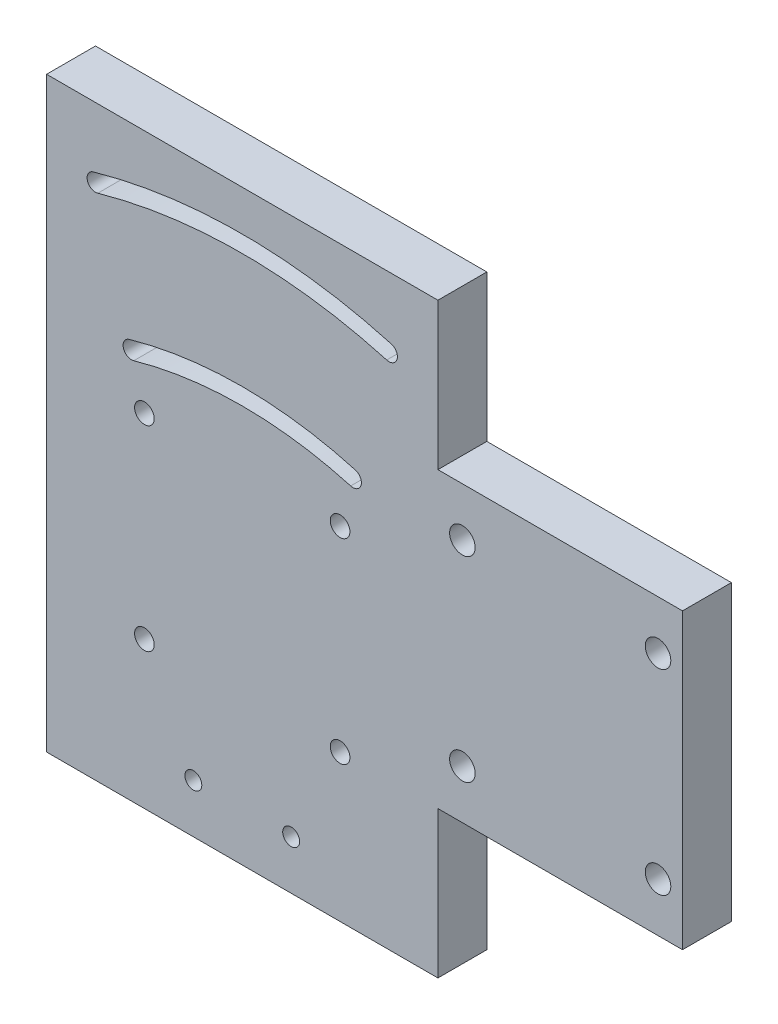
ISO-10303-21;
HEADER;
FILE_DESCRIPTION(('STEP AP214'),'2;1');
FILE_NAME('part.step','',(''),(''),'','','');
FILE_SCHEMA(('AUTOMOTIVE_DESIGN { 1 0 10303 214 1 1 1 1 }'));
ENDSEC;
DATA;
#1=APPLICATION_CONTEXT('core data for automotive mechanical design processes');
#2=APPLICATION_PROTOCOL_DEFINITION('international standard','automotive_design',2000,#1);
#3=PRODUCT_CONTEXT('',#1,'mechanical');
#4=PRODUCT('Part','Part','',(#3));
#5=PRODUCT_RELATED_PRODUCT_CATEGORY('part','',(#4));
#6=PRODUCT_DEFINITION_FORMATION('','',#4);
#7=PRODUCT_DEFINITION_CONTEXT('part definition',#1,'design');
#8=PRODUCT_DEFINITION('design','',#6,#7);
#9=PRODUCT_DEFINITION_SHAPE('','',#8);
#10=(LENGTH_UNIT() NAMED_UNIT(*) SI_UNIT(.MILLI.,.METRE.));
#11=(NAMED_UNIT(*) PLANE_ANGLE_UNIT() SI_UNIT($,.RADIAN.));
#12=(NAMED_UNIT(*) SI_UNIT($,.STERADIAN.) SOLID_ANGLE_UNIT());
#13=UNCERTAINTY_MEASURE_WITH_UNIT(LENGTH_MEASURE(1.E-05),#10,'distance_accuracy_value','');
#14=(GEOMETRIC_REPRESENTATION_CONTEXT(3) GLOBAL_UNCERTAINTY_ASSIGNED_CONTEXT((#13)) GLOBAL_UNIT_ASSIGNED_CONTEXT((#10,
#11,#12)) REPRESENTATION_CONTEXT('',''));
#15=CARTESIAN_POINT('',(0.,0.,0.));
#16=DIRECTION('',(0.,0.,1.));
#17=DIRECTION('',(1.,0.,0.));
#18=AXIS2_PLACEMENT_3D('',#15,#16,#17);
#19=CARTESIAN_POINT('',(101.6,38.1,0.));
#20=DIRECTION('',(0.,0.,1.));
#21=DIRECTION('',(1.,0.,0.));
#22=AXIS2_PLACEMENT_3D('',#19,#20,#21);
#23=PLANE('',#22);
#24=CARTESIAN_POINT('',(63.5,12.7,0.));
#25=DIRECTION('',(0.,0.,1.));
#26=DIRECTION('',(1.,0.,0.));
#27=AXIS2_PLACEMENT_3D('',#24,#25,#26);
#28=CIRCLE('',#27,2.1971);
#29=CARTESIAN_POINT('',(65.6971,12.7,0.));
#30=VERTEX_POINT('',#29);
#31=EDGE_CURVE('E498',#30,#30,#28,.T.);
#32=ORIENTED_EDGE('',*,*,#31,.T.);
#33=EDGE_LOOP('',(#32));
#34=FACE_BOUND('',#33,.T.);
#35=CARTESIAN_POINT('',(38.1,12.7,0.));
#36=DIRECTION('',(0.,0.,1.));
#37=DIRECTION('',(1.,0.,0.));
#38=AXIS2_PLACEMENT_3D('',#35,#36,#37);
#39=CIRCLE('',#38,2.1971);
#40=CARTESIAN_POINT('',(40.2971,12.7,0.));
#41=VERTEX_POINT('',#40);
#42=EDGE_CURVE('E501',#41,#41,#39,.T.);
#43=ORIENTED_EDGE('',*,*,#42,.T.);
#44=EDGE_LOOP('',(#43));
#45=FACE_BOUND('',#44,.T.);
#46=CARTESIAN_POINT('',(50.8,0.,0.));
#47=DIRECTION('',(0.,0.,-1.));
#48=DIRECTION('',(-1.,0.,0.));
#49=AXIS2_PLACEMENT_3D('',#46,#47,#48);
#50=CIRCLE('',#49,107.5944);
#51=CARTESIAN_POINT('',(21.4560727272727,103.515645404803,0.));
#52=VERTEX_POINT('',#51);
#53=CARTESIAN_POINT('',(80.1439272727273,103.515645404803,0.));
#54=VERTEX_POINT('',#53);
#55=EDGE_CURVE('E141',#52,#54,#50,.T.);
#56=ORIENTED_EDGE('',*,*,#55,.F.);
#57=CARTESIAN_POINT('',(22.0518181818181,101.41405298157,0.));
#58=DIRECTION('',(0.,0.,1.));
#59=DIRECTION('',(1.,0.,0.));
#60=AXIS2_PLACEMENT_3D('',#57,#58,#59);
#61=CIRCLE('',#60,2.1844);
#62=CARTESIAN_POINT('',(22.6475636363636,99.3124605583378,0.));
#63=VERTEX_POINT('',#62);
#64=EDGE_CURVE('E148',#52,#63,#61,.T.);
#65=ORIENTED_EDGE('',*,*,#64,.T.);
#66=CARTESIAN_POINT('',(50.8,0.,0.));
#67=DIRECTION('',(0.,0.,-1.));
#68=DIRECTION('',(-1.,0.,0.));
#69=AXIS2_PLACEMENT_3D('',#66,#67,#68);
#70=CIRCLE('',#69,103.2256);
#71=CARTESIAN_POINT('',(78.9524363636364,99.3124605583378,0.));
#72=VERTEX_POINT('',#71);
#73=EDGE_CURVE('E154',#63,#72,#70,.T.);
#74=ORIENTED_EDGE('',*,*,#73,.T.);
#75=CARTESIAN_POINT('',(79.5481818181818,101.41405298157,0.));
#76=DIRECTION('',(0.,0.,1.));
#77=DIRECTION('',(1.,0.,0.));
#78=AXIS2_PLACEMENT_3D('',#75,#76,#77);
#79=CIRCLE('',#78,2.18440000000001);
#80=EDGE_CURVE('E39',#72,#54,#79,.T.);
#81=ORIENTED_EDGE('',*,*,#80,.T.);
#82=EDGE_LOOP('',(#56,#65,#74,#81));
#83=FACE_BOUND('',#82,.T.);
#84=CARTESIAN_POINT('',(107.95,50.8,0.));
#85=DIRECTION('',(0.,0.,1.));
#86=DIRECTION('',(1.,0.,0.));
#87=AXIS2_PLACEMENT_3D('',#84,#85,#86);
#88=CIRCLE('',#87,3.31470000000001);
#89=CARTESIAN_POINT('',(111.2647,50.8,0.));
#90=VERTEX_POINT('',#89);
#91=EDGE_CURVE('E32',#90,#90,#88,.T.);
#92=ORIENTED_EDGE('',*,*,#91,.T.);
#93=EDGE_LOOP('',(#92));
#94=FACE_BOUND('',#93,.T.);
#95=CARTESIAN_POINT('',(158.75,50.8,0.));
#96=DIRECTION('',(0.,0.,1.));
#97=DIRECTION('',(1.,0.,0.));
#98=AXIS2_PLACEMENT_3D('',#95,#96,#97);
#99=CIRCLE('',#98,3.31470000000001);
#100=CARTESIAN_POINT('',(162.0647,50.8,0.));
#101=VERTEX_POINT('',#100);
#102=EDGE_CURVE('E298',#101,#101,#99,.T.);
#103=ORIENTED_EDGE('',*,*,#102,.T.);
#104=EDGE_LOOP('',(#103));
#105=FACE_BOUND('',#104,.T.);
#106=CARTESIAN_POINT('',(25.4,38.1,0.));
#107=DIRECTION('',(0.,0.,1.));
#108=DIRECTION('',(1.,0.,0.));
#109=AXIS2_PLACEMENT_3D('',#106,#107,#108);
#110=CIRCLE('',#109,2.55270000000001);
#111=CARTESIAN_POINT('',(27.9527,38.1,0.));
#112=VERTEX_POINT('',#111);
#113=EDGE_CURVE('E292',#112,#112,#110,.T.);
#114=ORIENTED_EDGE('',*,*,#113,.T.);
#115=EDGE_LOOP('',(#114));
#116=FACE_BOUND('',#115,.T.);
#117=CARTESIAN_POINT('',(76.2,38.1,0.));
#118=DIRECTION('',(0.,0.,1.));
#119=DIRECTION('',(1.,0.,0.));
#120=AXIS2_PLACEMENT_3D('',#117,#118,#119);
#121=CIRCLE('',#120,2.55270000000001);
#122=CARTESIAN_POINT('',(78.7527,38.1,0.));
#123=VERTEX_POINT('',#122);
#124=EDGE_CURVE('E286',#123,#123,#121,.T.);
#125=ORIENTED_EDGE('',*,*,#124,.T.);
#126=EDGE_LOOP('',(#125));
#127=FACE_BOUND('',#126,.T.);
#128=DIRECTION('',(1.,0.,0.));
#129=VECTOR('',#128,1.);
#130=CARTESIAN_POINT('',(101.6,38.1,0.));
#131=LINE('',#130,#129);
#132=CARTESIAN_POINT('',(101.6,38.1,0.));
#133=VERTEX_POINT('',#132);
#134=CARTESIAN_POINT('',(165.1,38.1,0.));
#135=VERTEX_POINT('',#134);
#136=EDGE_CURVE('E254',#133,#135,#131,.T.);
#137=ORIENTED_EDGE('',*,*,#136,.F.);
#138=DIRECTION('',(0.,1.,0.));
#139=VECTOR('',#138,1.);
#140=CARTESIAN_POINT('',(101.6,0.,0.));
#141=LINE('',#140,#139);
#142=CARTESIAN_POINT('',(101.6,0.,0.));
#143=VERTEX_POINT('',#142);
#144=EDGE_CURVE('E231',#143,#133,#141,.T.);
#145=ORIENTED_EDGE('',*,*,#144,.F.);
#146=DIRECTION('',(1.,0.,0.));
#147=VECTOR('',#146,1.);
#148=CARTESIAN_POINT('',(0.,0.,0.));
#149=LINE('',#148,#147);
#150=CARTESIAN_POINT('',(0.,0.,0.));
#151=VERTEX_POINT('',#150);
#152=EDGE_CURVE('E234',#151,#143,#149,.T.);
#153=ORIENTED_EDGE('',*,*,#152,.F.);
#154=DIRECTION('',(0.,1.,0.));
#155=VECTOR('',#154,1.);
#156=CARTESIAN_POINT('',(0.,0.,0.));
#157=LINE('',#156,#155);
#158=CARTESIAN_POINT('',(0.,152.4,0.));
#159=VERTEX_POINT('',#158);
#160=EDGE_CURVE('E236',#151,#159,#157,.T.);
#161=ORIENTED_EDGE('',*,*,#160,.T.);
#162=DIRECTION('',(1.,0.,0.));
#163=VECTOR('',#162,1.);
#164=CARTESIAN_POINT('',(0.,152.4,0.));
#165=LINE('',#164,#163);
#166=CARTESIAN_POINT('',(101.6,152.4,0.));
#167=VERTEX_POINT('',#166);
#168=EDGE_CURVE('E227',#159,#167,#165,.T.);
#169=ORIENTED_EDGE('',*,*,#168,.T.);
#170=CARTESIAN_POINT('',(101.6,114.3,0.));
#171=VERTEX_POINT('',#170);
#172=EDGE_CURVE('E230',#171,#167,#141,.T.);
#173=ORIENTED_EDGE('',*,*,#172,.F.);
#174=DIRECTION('',(1.,0.,0.));
#175=VECTOR('',#174,1.);
#176=CARTESIAN_POINT('',(101.6,114.3,0.));
#177=LINE('',#176,#175);
#178=CARTESIAN_POINT('',(165.1,114.3,0.));
#179=VERTEX_POINT('',#178);
#180=EDGE_CURVE('E267',#171,#179,#177,.T.);
#181=ORIENTED_EDGE('',*,*,#180,.T.);
#182=DIRECTION('',(0.,-1.,0.));
#183=VECTOR('',#182,1.);
#184=CARTESIAN_POINT('',(165.1,114.3,0.));
#185=LINE('',#184,#183);
#186=EDGE_CURVE('E264',#179,#135,#185,.T.);
#187=ORIENTED_EDGE('',*,*,#186,.T.);
#188=EDGE_LOOP('',(#137,#145,#153,#161,#169,#173,#181,#187));
#189=FACE_BOUND('',#188,.T.);
#190=CARTESIAN_POINT('',(158.75,101.6,0.));
#191=DIRECTION('',(0.,0.,1.));
#192=DIRECTION('',(1.,0.,0.));
#193=AXIS2_PLACEMENT_3D('',#190,#191,#192);
#194=CIRCLE('',#193,3.31470000000001);
#195=CARTESIAN_POINT('',(162.0647,101.6,0.));
#196=VERTEX_POINT('',#195);
#197=EDGE_CURVE('E224',#196,#196,#194,.T.);
#198=ORIENTED_EDGE('',*,*,#197,.T.);
#199=EDGE_LOOP('',(#198));
#200=FACE_BOUND('',#199,.T.);
#201=CARTESIAN_POINT('',(76.2,88.9,0.));
#202=DIRECTION('',(0.,0.,1.));
#203=DIRECTION('',(1.,0.,0.));
#204=AXIS2_PLACEMENT_3D('',#201,#202,#203);
#205=CIRCLE('',#204,2.55270000000001);
#206=CARTESIAN_POINT('',(78.7527,88.9,0.));
#207=VERTEX_POINT('',#206);
#208=EDGE_CURVE('E218',#207,#207,#205,.T.);
#209=ORIENTED_EDGE('',*,*,#208,.T.);
#210=EDGE_LOOP('',(#209));
#211=FACE_BOUND('',#210,.T.);
#212=CARTESIAN_POINT('',(25.4,88.9,0.));
#213=DIRECTION('',(0.,0.,1.));
#214=DIRECTION('',(1.,0.,0.));
#215=AXIS2_PLACEMENT_3D('',#212,#213,#214);
#216=CIRCLE('',#215,2.55270000000001);
#217=CARTESIAN_POINT('',(27.9527,88.9,0.));
#218=VERTEX_POINT('',#217);
#219=EDGE_CURVE('E209',#218,#218,#216,.T.);
#220=ORIENTED_EDGE('',*,*,#219,.T.);
#221=EDGE_LOOP('',(#220));
#222=FACE_BOUND('',#221,.T.);
#223=CARTESIAN_POINT('',(107.95,101.6,0.));
#224=DIRECTION('',(0.,0.,1.));
#225=DIRECTION('',(1.,0.,0.));
#226=AXIS2_PLACEMENT_3D('',#223,#224,#225);
#227=CIRCLE('',#226,3.31470000000001);
#228=CARTESIAN_POINT('',(111.2647,101.6,0.));
#229=VERTEX_POINT('',#228);
#230=EDGE_CURVE('E197',#229,#229,#227,.T.);
#231=ORIENTED_EDGE('',*,*,#230,.T.);
#232=EDGE_LOOP('',(#231));
#233=FACE_BOUND('',#232,.T.);
#234=CARTESIAN_POINT('',(50.8,0.,0.));
#235=DIRECTION('',(0.,0.,-1.));
#236=DIRECTION('',(-1.,0.,0.));
#237=AXIS2_PLACEMENT_3D('',#234,#235,#236);
#238=CIRCLE('',#237,141.8844);
#239=CARTESIAN_POINT('',(12.1042545454546,136.505759025314,0.));
#240=VERTEX_POINT('',#239);
#241=CARTESIAN_POINT('',(89.4957454545455,136.505759025314,0.));
#242=VERTEX_POINT('',#241);
#243=EDGE_CURVE('E192',#240,#242,#238,.T.);
#244=ORIENTED_EDGE('',*,*,#243,.F.);
#245=CARTESIAN_POINT('',(12.7,134.404166602081,0.));
#246=DIRECTION('',(0.,0.,1.));
#247=DIRECTION('',(1.,0.,0.));
#248=AXIS2_PLACEMENT_3D('',#245,#246,#247);
#249=CIRCLE('',#248,2.1844);
#250=CARTESIAN_POINT('',(13.2957454545455,132.302574178849,0.));
#251=VERTEX_POINT('',#250);
#252=EDGE_CURVE('E183',#240,#251,#249,.T.);
#253=ORIENTED_EDGE('',*,*,#252,.T.);
#254=CARTESIAN_POINT('',(50.8,0.,0.));
#255=DIRECTION('',(0.,0.,-1.));
#256=DIRECTION('',(-1.,0.,0.));
#257=AXIS2_PLACEMENT_3D('',#254,#255,#256);
#258=CIRCLE('',#257,137.5156);
#259=CARTESIAN_POINT('',(88.3042545454546,132.302574178849,0.));
#260=VERTEX_POINT('',#259);
#261=EDGE_CURVE('E186',#251,#260,#258,.T.);
#262=ORIENTED_EDGE('',*,*,#261,.T.);
#263=CARTESIAN_POINT('',(88.9,134.404166602081,0.));
#264=DIRECTION('',(0.,0.,1.));
#265=DIRECTION('',(1.,0.,0.));
#266=AXIS2_PLACEMENT_3D('',#263,#264,#265);
#267=CIRCLE('',#266,2.1844);
#268=EDGE_CURVE('E189',#260,#242,#267,.T.);
#269=ORIENTED_EDGE('',*,*,#268,.T.);
#270=EDGE_LOOP('',(#244,#253,#262,#269));
#271=FACE_BOUND('',#270,.T.);
#272=ADVANCED_FACE('F24',(#34,#45,#83,#94,#105,#116,#127,#189,#200,#211,#222,#233,#271),#23,.F.);
#273=CARTESIAN_POINT('',(101.6,38.1,12.7));
#274=DIRECTION('',(0.,1.,0.));
#275=DIRECTION('',(0.,0.,1.));
#276=AXIS2_PLACEMENT_3D('',#273,#274,#275);
#277=PLANE('',#276);
#278=ORIENTED_EDGE('',*,*,#136,.T.);
#279=DIRECTION('',(0.,0.,-1.));
#280=VECTOR('',#279,1.);
#281=CARTESIAN_POINT('',(165.1,38.1,12.7));
#282=LINE('',#281,#280);
#283=CARTESIAN_POINT('',(165.1,38.1,12.7));
#284=VERTEX_POINT('',#283);
#285=EDGE_CURVE('E282',#284,#135,#282,.T.);
#286=ORIENTED_EDGE('',*,*,#285,.F.);
#287=DIRECTION('',(1.,0.,0.));
#288=VECTOR('',#287,1.);
#289=CARTESIAN_POINT('',(101.6,38.1,12.7));
#290=LINE('',#289,#288);
#291=CARTESIAN_POINT('',(101.6,38.1,12.7));
#292=VERTEX_POINT('',#291);
#293=EDGE_CURVE('E270',#292,#284,#290,.T.);
#294=ORIENTED_EDGE('',*,*,#293,.F.);
#295=DIRECTION('',(0.,0.,-1.));
#296=VECTOR('',#295,1.);
#297=CARTESIAN_POINT('',(101.6,38.1,12.7));
#298=LINE('',#297,#296);
#299=EDGE_CURVE('E284',#292,#133,#298,.T.);
#300=ORIENTED_EDGE('',*,*,#299,.T.);
#301=EDGE_LOOP('',(#278,#286,#294,#300));
#302=FACE_BOUND('',#301,.T.);
#303=ADVANCED_FACE('F341',(#302),#277,.F.);
#304=CARTESIAN_POINT('',(165.1,114.3,12.7));
#305=DIRECTION('',(1.,0.,0.));
#306=DIRECTION('',(0.,0.,-1.));
#307=AXIS2_PLACEMENT_3D('',#304,#305,#306);
#308=PLANE('',#307);
#309=ORIENTED_EDGE('',*,*,#186,.F.);
#310=DIRECTION('',(0.,0.,-1.));
#311=VECTOR('',#310,1.);
#312=CARTESIAN_POINT('',(165.1,114.3,12.7));
#313=LINE('',#312,#311);
#314=CARTESIAN_POINT('',(165.1,114.3,12.7));
#315=VERTEX_POINT('',#314);
#316=EDGE_CURVE('E280',#315,#179,#313,.T.);
#317=ORIENTED_EDGE('',*,*,#316,.F.);
#318=DIRECTION('',(0.,-1.,0.));
#319=VECTOR('',#318,1.);
#320=CARTESIAN_POINT('',(165.1,114.3,12.7));
#321=LINE('',#320,#319);
#322=EDGE_CURVE('E272',#315,#284,#321,.T.);
#323=ORIENTED_EDGE('',*,*,#322,.T.);
#324=ORIENTED_EDGE('',*,*,#285,.T.);
#325=EDGE_LOOP('',(#309,#317,#323,#324));
#326=FACE_BOUND('',#325,.T.);
#327=ADVANCED_FACE('F330',(#326),#308,.T.);
#328=CARTESIAN_POINT('',(101.6,114.3,12.7));
#329=DIRECTION('',(0.,1.,0.));
#330=DIRECTION('',(0.,0.,1.));
#331=AXIS2_PLACEMENT_3D('',#328,#329,#330);
#332=PLANE('',#331);
#333=ORIENTED_EDGE('',*,*,#180,.F.);
#334=DIRECTION('',(0.,0.,-1.));
#335=VECTOR('',#334,1.);
#336=CARTESIAN_POINT('',(101.6,114.3,12.7));
#337=LINE('',#336,#335);
#338=CARTESIAN_POINT('',(101.6,114.3,12.7));
#339=VERTEX_POINT('',#338);
#340=EDGE_CURVE('E278',#339,#171,#337,.T.);
#341=ORIENTED_EDGE('',*,*,#340,.F.);
#342=DIRECTION('',(1.,0.,0.));
#343=VECTOR('',#342,1.);
#344=CARTESIAN_POINT('',(101.6,114.3,12.7));
#345=LINE('',#344,#343);
#346=EDGE_CURVE('E275',#339,#315,#345,.T.);
#347=ORIENTED_EDGE('',*,*,#346,.T.);
#348=ORIENTED_EDGE('',*,*,#316,.T.);
#349=EDGE_LOOP('',(#333,#341,#347,#348));
#350=FACE_BOUND('',#349,.T.);
#351=ADVANCED_FACE('F316',(#350),#332,.T.);
#352=CARTESIAN_POINT('',(101.6,38.1,12.7));
#353=DIRECTION('',(0.,0.,1.));
#354=DIRECTION('',(1.,0.,0.));
#355=AXIS2_PLACEMENT_3D('',#352,#353,#354);
#356=PLANE('',#355);
#357=CARTESIAN_POINT('',(63.5,12.7,12.7));
#358=DIRECTION('',(0.,0.,1.));
#359=DIRECTION('',(1.,0.,0.));
#360=AXIS2_PLACEMENT_3D('',#357,#358,#359);
#361=CIRCLE('',#360,2.1971);
#362=CARTESIAN_POINT('',(65.6971,12.7,12.7));
#363=VERTEX_POINT('',#362);
#364=EDGE_CURVE('E500',#363,#363,#361,.T.);
#365=ORIENTED_EDGE('',*,*,#364,.F.);
#366=EDGE_LOOP('',(#365));
#367=FACE_BOUND('',#366,.T.);
#368=CARTESIAN_POINT('',(38.1,12.7,12.7));
#369=DIRECTION('',(0.,0.,1.));
#370=DIRECTION('',(1.,0.,0.));
#371=AXIS2_PLACEMENT_3D('',#368,#369,#370);
#372=CIRCLE('',#371,2.1971);
#373=CARTESIAN_POINT('',(40.2971,12.7,12.7));
#374=VERTEX_POINT('',#373);
#375=EDGE_CURVE('E145',#374,#374,#372,.T.);
#376=ORIENTED_EDGE('',*,*,#375,.F.);
#377=EDGE_LOOP('',(#376));
#378=FACE_BOUND('',#377,.T.);
#379=CARTESIAN_POINT('',(22.0518181818181,101.41405298157,12.7));
#380=DIRECTION('',(0.,0.,1.));
#381=DIRECTION('',(1.,0.,0.));
#382=AXIS2_PLACEMENT_3D('',#379,#380,#381);
#383=CIRCLE('',#382,2.1844);
#384=CARTESIAN_POINT('',(21.4560727272727,103.515645404803,12.7));
#385=VERTEX_POINT('',#384);
#386=CARTESIAN_POINT('',(22.6475636363636,99.3124605583378,12.7));
#387=VERTEX_POINT('',#386);
#388=EDGE_CURVE('E47',#385,#387,#383,.T.);
#389=ORIENTED_EDGE('',*,*,#388,.F.);
#390=CARTESIAN_POINT('',(50.8,0.,12.7));
#391=DIRECTION('',(0.,0.,-1.));
#392=DIRECTION('',(-1.,0.,0.));
#393=AXIS2_PLACEMENT_3D('',#390,#391,#392);
#394=CIRCLE('',#393,107.5944);
#395=CARTESIAN_POINT('',(80.1439272727273,103.515645404803,12.7));
#396=VERTEX_POINT('',#395);
#397=EDGE_CURVE('E143',#385,#396,#394,.T.);
#398=ORIENTED_EDGE('',*,*,#397,.T.);
#399=CARTESIAN_POINT('',(79.5481818181818,101.41405298157,12.7));
#400=DIRECTION('',(0.,0.,1.));
#401=DIRECTION('',(1.,0.,0.));
#402=AXIS2_PLACEMENT_3D('',#399,#400,#401);
#403=CIRCLE('',#402,2.18440000000001);
#404=CARTESIAN_POINT('',(78.9524363636364,99.3124605583378,12.7));
#405=VERTEX_POINT('',#404);
#406=EDGE_CURVE('E165',#405,#396,#403,.T.);
#407=ORIENTED_EDGE('',*,*,#406,.F.);
#408=CARTESIAN_POINT('',(50.8,0.,12.7));
#409=DIRECTION('',(0.,0.,-1.));
#410=DIRECTION('',(-1.,0.,0.));
#411=AXIS2_PLACEMENT_3D('',#408,#409,#410);
#412=CIRCLE('',#411,103.2256);
#413=EDGE_CURVE('E168',#387,#405,#412,.T.);
#414=ORIENTED_EDGE('',*,*,#413,.F.);
#415=EDGE_LOOP('',(#389,#398,#407,#414));
#416=FACE_BOUND('',#415,.T.);
#417=CARTESIAN_POINT('',(12.7,134.404166602081,12.7));
#418=DIRECTION('',(0.,0.,1.));
#419=DIRECTION('',(1.,0.,0.));
#420=AXIS2_PLACEMENT_3D('',#417,#418,#419);
#421=CIRCLE('',#420,2.1844);
#422=CARTESIAN_POINT('',(12.1042545454546,136.505759025314,12.7));
#423=VERTEX_POINT('',#422);
#424=CARTESIAN_POINT('',(13.2957454545455,132.302574178849,12.7));
#425=VERTEX_POINT('',#424);
#426=EDGE_CURVE('E172',#423,#425,#421,.T.);
#427=ORIENTED_EDGE('',*,*,#426,.F.);
#428=CARTESIAN_POINT('',(50.8,0.,12.7));
#429=DIRECTION('',(0.,0.,-1.));
#430=DIRECTION('',(-1.,0.,0.));
#431=AXIS2_PLACEMENT_3D('',#428,#429,#430);
#432=CIRCLE('',#431,141.8844);
#433=CARTESIAN_POINT('',(89.4957454545455,136.505759025314,12.7));
#434=VERTEX_POINT('',#433);
#435=EDGE_CURVE('E180',#423,#434,#432,.T.);
#436=ORIENTED_EDGE('',*,*,#435,.T.);
#437=CARTESIAN_POINT('',(88.9,134.404166602081,12.7));
#438=DIRECTION('',(0.,0.,1.));
#439=DIRECTION('',(1.,0.,0.));
#440=AXIS2_PLACEMENT_3D('',#437,#438,#439);
#441=CIRCLE('',#440,2.1844);
#442=CARTESIAN_POINT('',(88.3042545454546,132.302574178849,12.7));
#443=VERTEX_POINT('',#442);
#444=EDGE_CURVE('E177',#443,#434,#441,.T.);
#445=ORIENTED_EDGE('',*,*,#444,.F.);
#446=CARTESIAN_POINT('',(50.8,0.,12.7));
#447=DIRECTION('',(0.,0.,-1.));
#448=DIRECTION('',(-1.,0.,0.));
#449=AXIS2_PLACEMENT_3D('',#446,#447,#448);
#450=CIRCLE('',#449,137.5156);
#451=EDGE_CURVE('E174',#425,#443,#450,.T.);
#452=ORIENTED_EDGE('',*,*,#451,.F.);
#453=EDGE_LOOP('',(#427,#436,#445,#452));
#454=FACE_BOUND('',#453,.T.);
#455=CARTESIAN_POINT('',(107.95,101.6,12.7));
#456=DIRECTION('',(0.,0.,1.));
#457=DIRECTION('',(1.,0.,0.));
#458=AXIS2_PLACEMENT_3D('',#455,#456,#457);
#459=CIRCLE('',#458,3.31470000000001);
#460=CARTESIAN_POINT('',(111.2647,101.6,12.7));
#461=VERTEX_POINT('',#460);
#462=EDGE_CURVE('E206',#461,#461,#459,.T.);
#463=ORIENTED_EDGE('',*,*,#462,.F.);
#464=EDGE_LOOP('',(#463));
#465=FACE_BOUND('',#464,.T.);
#466=CARTESIAN_POINT('',(25.4,88.9,12.7));
#467=DIRECTION('',(0.,0.,1.));
#468=DIRECTION('',(1.,0.,0.));
#469=AXIS2_PLACEMENT_3D('',#466,#467,#468);
#470=CIRCLE('',#469,2.55270000000001);
#471=CARTESIAN_POINT('',(27.9527,88.9,12.7));
#472=VERTEX_POINT('',#471);
#473=EDGE_CURVE('E212',#472,#472,#470,.T.);
#474=ORIENTED_EDGE('',*,*,#473,.F.);
#475=EDGE_LOOP('',(#474));
#476=FACE_BOUND('',#475,.T.);
#477=CARTESIAN_POINT('',(76.2,88.9,12.7));
#478=DIRECTION('',(0.,0.,1.));
#479=DIRECTION('',(1.,0.,0.));
#480=AXIS2_PLACEMENT_3D('',#477,#478,#479);
#481=CIRCLE('',#480,2.55270000000001);
#482=CARTESIAN_POINT('',(78.7527,88.9,12.7));
#483=VERTEX_POINT('',#482);
#484=EDGE_CURVE('E215',#483,#483,#481,.T.);
#485=ORIENTED_EDGE('',*,*,#484,.F.);
#486=EDGE_LOOP('',(#485));
#487=FACE_BOUND('',#486,.T.);
#488=CARTESIAN_POINT('',(158.75,101.6,12.7));
#489=DIRECTION('',(0.,0.,1.));
#490=DIRECTION('',(1.,0.,0.));
#491=AXIS2_PLACEMENT_3D('',#488,#489,#490);
#492=CIRCLE('',#491,3.31470000000001);
#493=CARTESIAN_POINT('',(162.0647,101.6,12.7));
#494=VERTEX_POINT('',#493);
#495=EDGE_CURVE('E221',#494,#494,#492,.T.);
#496=ORIENTED_EDGE('',*,*,#495,.F.);
#497=EDGE_LOOP('',(#496));
#498=FACE_BOUND('',#497,.T.);
#499=ORIENTED_EDGE('',*,*,#346,.F.);
#500=DIRECTION('',(0.,1.,0.));
#501=VECTOR('',#500,1.);
#502=CARTESIAN_POINT('',(101.6,0.,12.7));
#503=LINE('',#502,#501);
#504=CARTESIAN_POINT('',(101.6,152.4,12.7));
#505=VERTEX_POINT('',#504);
#506=EDGE_CURVE('E242',#339,#505,#503,.T.);
#507=ORIENTED_EDGE('',*,*,#506,.T.);
#508=DIRECTION('',(1.,0.,0.));
#509=VECTOR('',#508,1.);
#510=CARTESIAN_POINT('',(0.,152.4,12.7));
#511=LINE('',#510,#509);
#512=CARTESIAN_POINT('',(0.,152.4,12.7));
#513=VERTEX_POINT('',#512);
#514=EDGE_CURVE('E239',#513,#505,#511,.T.);
#515=ORIENTED_EDGE('',*,*,#514,.F.);
#516=DIRECTION('',(0.,1.,0.));
#517=VECTOR('',#516,1.);
#518=CARTESIAN_POINT('',(0.,0.,12.7));
#519=LINE('',#518,#517);
#520=CARTESIAN_POINT('',(0.,0.,12.7));
#521=VERTEX_POINT('',#520);
#522=EDGE_CURVE('E248',#521,#513,#519,.T.);
#523=ORIENTED_EDGE('',*,*,#522,.F.);
#524=DIRECTION('',(1.,0.,0.));
#525=VECTOR('',#524,1.);
#526=CARTESIAN_POINT('',(0.,0.,12.7));
#527=LINE('',#526,#525);
#528=CARTESIAN_POINT('',(101.6,0.,12.7));
#529=VERTEX_POINT('',#528);
#530=EDGE_CURVE('E246',#521,#529,#527,.T.);
#531=ORIENTED_EDGE('',*,*,#530,.T.);
#532=EDGE_CURVE('E243',#529,#292,#503,.T.);
#533=ORIENTED_EDGE('',*,*,#532,.T.);
#534=ORIENTED_EDGE('',*,*,#293,.T.);
#535=ORIENTED_EDGE('',*,*,#322,.F.);
#536=EDGE_LOOP('',(#499,#507,#515,#523,#531,#533,#534,#535));
#537=FACE_BOUND('',#536,.T.);
#538=CARTESIAN_POINT('',(76.2,38.1,12.7));
#539=DIRECTION('',(0.,0.,1.));
#540=DIRECTION('',(1.,0.,0.));
#541=AXIS2_PLACEMENT_3D('',#538,#539,#540);
#542=CIRCLE('',#541,2.55270000000001);
#543=CARTESIAN_POINT('',(78.7527,38.1,12.7));
#544=VERTEX_POINT('',#543);
#545=EDGE_CURVE('E289',#544,#544,#542,.T.);
#546=ORIENTED_EDGE('',*,*,#545,.F.);
#547=EDGE_LOOP('',(#546));
#548=FACE_BOUND('',#547,.T.);
#549=CARTESIAN_POINT('',(25.4,38.1,12.7));
#550=DIRECTION('',(0.,0.,1.));
#551=DIRECTION('',(1.,0.,0.));
#552=AXIS2_PLACEMENT_3D('',#549,#550,#551);
#553=CIRCLE('',#552,2.55270000000001);
#554=CARTESIAN_POINT('',(27.9527,38.1,12.7));
#555=VERTEX_POINT('',#554);
#556=EDGE_CURVE('E295',#555,#555,#553,.T.);
#557=ORIENTED_EDGE('',*,*,#556,.F.);
#558=EDGE_LOOP('',(#557));
#559=FACE_BOUND('',#558,.T.);
#560=CARTESIAN_POINT('',(158.75,50.8,12.7));
#561=DIRECTION('',(0.,0.,1.));
#562=DIRECTION('',(1.,0.,0.));
#563=AXIS2_PLACEMENT_3D('',#560,#561,#562);
#564=CIRCLE('',#563,3.31470000000001);
#565=CARTESIAN_POINT('',(162.0647,50.8,12.7));
#566=VERTEX_POINT('',#565);
#567=EDGE_CURVE('E301',#566,#566,#564,.T.);
#568=ORIENTED_EDGE('',*,*,#567,.F.);
#569=EDGE_LOOP('',(#568));
#570=FACE_BOUND('',#569,.T.);
#571=CARTESIAN_POINT('',(107.95,50.8,12.7));
#572=DIRECTION('',(0.,0.,1.));
#573=DIRECTION('',(1.,0.,0.));
#574=AXIS2_PLACEMENT_3D('',#571,#572,#573);
#575=CIRCLE('',#574,3.31470000000001);
#576=CARTESIAN_POINT('',(111.2647,50.8,12.7));
#577=VERTEX_POINT('',#576);
#578=EDGE_CURVE('E11',#577,#577,#575,.T.);
#579=ORIENTED_EDGE('',*,*,#578,.F.);
#580=EDGE_LOOP('',(#579));
#581=FACE_BOUND('',#580,.T.);
#582=ADVANCED_FACE('F313',(#367,#378,#416,#454,#465,#476,#487,#498,#537,#548,#559,#570,#581),
#356,.T.);
#583=CARTESIAN_POINT('',(0.,0.,12.7));
#584=DIRECTION('',(-1.,0.,0.));
#585=DIRECTION('',(0.,0.,1.));
#586=AXIS2_PLACEMENT_3D('',#583,#584,#585);
#587=PLANE('',#586);
#588=ORIENTED_EDGE('',*,*,#160,.F.);
#589=DIRECTION('',(0.,0.,-1.));
#590=VECTOR('',#589,1.);
#591=CARTESIAN_POINT('',(0.,0.,12.7));
#592=LINE('',#591,#590);
#593=EDGE_CURVE('E255',#521,#151,#592,.T.);
#594=ORIENTED_EDGE('',*,*,#593,.F.);
#595=ORIENTED_EDGE('',*,*,#522,.T.);
#596=DIRECTION('',(0.,0.,-1.));
#597=VECTOR('',#596,1.);
#598=CARTESIAN_POINT('',(0.,152.4,12.7));
#599=LINE('',#598,#597);
#600=EDGE_CURVE('E252',#513,#159,#599,.T.);
#601=ORIENTED_EDGE('',*,*,#600,.T.);
#602=EDGE_LOOP('',(#588,#594,#595,#601));
#603=FACE_BOUND('',#602,.T.);
#604=ADVANCED_FACE('F315',(#603),#587,.T.);
#605=CARTESIAN_POINT('',(0.,0.,12.7));
#606=DIRECTION('',(0.,1.,0.));
#607=DIRECTION('',(0.,0.,1.));
#608=AXIS2_PLACEMENT_3D('',#605,#606,#607);
#609=PLANE('',#608);
#610=ORIENTED_EDGE('',*,*,#152,.T.);
#611=DIRECTION('',(0.,0.,-1.));
#612=VECTOR('',#611,1.);
#613=CARTESIAN_POINT('',(101.6,0.,12.7));
#614=LINE('',#613,#612);
#615=EDGE_CURVE('E257',#529,#143,#614,.T.);
#616=ORIENTED_EDGE('',*,*,#615,.F.);
#617=ORIENTED_EDGE('',*,*,#530,.F.);
#618=ORIENTED_EDGE('',*,*,#593,.T.);
#619=EDGE_LOOP('',(#610,#616,#617,#618));
#620=FACE_BOUND('',#619,.T.);
#621=ADVANCED_FACE('F325',(#620),#609,.F.);
#622=CARTESIAN_POINT('',(0.,152.4,12.7));
#623=DIRECTION('',(0.,1.,0.));
#624=DIRECTION('',(0.,0.,1.));
#625=AXIS2_PLACEMENT_3D('',#622,#623,#624);
#626=PLANE('',#625);
#627=ORIENTED_EDGE('',*,*,#168,.F.);
#628=ORIENTED_EDGE('',*,*,#600,.F.);
#629=ORIENTED_EDGE('',*,*,#514,.T.);
#630=DIRECTION('',(0.,0.,-1.));
#631=VECTOR('',#630,1.);
#632=CARTESIAN_POINT('',(101.6,152.4,12.7));
#633=LINE('',#632,#631);
#634=EDGE_CURVE('E251',#505,#167,#633,.T.);
#635=ORIENTED_EDGE('',*,*,#634,.T.);
#636=EDGE_LOOP('',(#627,#628,#629,#635));
#637=FACE_BOUND('',#636,.T.);
#638=ADVANCED_FACE('F328',(#637),#626,.T.);
#639=CARTESIAN_POINT('',(101.6,0.,12.7));
#640=DIRECTION('',(-1.,0.,0.));
#641=DIRECTION('',(0.,-1.,0.));
#642=AXIS2_PLACEMENT_3D('',#639,#640,#641);
#643=PLANE('',#642);
#644=ORIENTED_EDGE('',*,*,#340,.T.);
#645=ORIENTED_EDGE('',*,*,#172,.T.);
#646=ORIENTED_EDGE('',*,*,#634,.F.);
#647=ORIENTED_EDGE('',*,*,#506,.F.);
#648=EDGE_LOOP('',(#644,#645,#646,#647));
#649=FACE_BOUND('',#648,.T.);
#650=ADVANCED_FACE('F348',(#649),#643,.F.);
#651=ORIENTED_EDGE('',*,*,#144,.T.);
#652=ORIENTED_EDGE('',*,*,#299,.F.);
#653=ORIENTED_EDGE('',*,*,#532,.F.);
#654=ORIENTED_EDGE('',*,*,#615,.T.);
#655=EDGE_LOOP('',(#651,#652,#653,#654));
#656=FACE_BOUND('',#655,.T.);
#657=ADVANCED_FACE('F338',(#656),#643,.F.);
#658=CARTESIAN_POINT('',(158.75,101.6,0.));
#659=DIRECTION('',(0.,0.,1.));
#660=DIRECTION('',(1.,0.,0.));
#661=AXIS2_PLACEMENT_3D('',#658,#659,#660);
#662=CYLINDRICAL_SURFACE('',#661,3.31470000000001);
#663=ORIENTED_EDGE('',*,*,#197,.F.);
#664=EDGE_LOOP('',(#663));
#665=FACE_BOUND('',#664,.T.);
#666=ORIENTED_EDGE('',*,*,#495,.T.);
#667=EDGE_LOOP('',(#666));
#668=FACE_BOUND('',#667,.T.);
#669=ADVANCED_FACE('F319',(#665,#668),#662,.F.);
#670=CARTESIAN_POINT('',(76.2,88.9,0.));
#671=DIRECTION('',(0.,0.,1.));
#672=DIRECTION('',(1.,0.,0.));
#673=AXIS2_PLACEMENT_3D('',#670,#671,#672);
#674=CYLINDRICAL_SURFACE('',#673,2.55270000000001);
#675=ORIENTED_EDGE('',*,*,#208,.F.);
#676=EDGE_LOOP('',(#675));
#677=FACE_BOUND('',#676,.T.);
#678=ORIENTED_EDGE('',*,*,#484,.T.);
#679=EDGE_LOOP('',(#678));
#680=FACE_BOUND('',#679,.T.);
#681=ADVANCED_FACE('F337',(#677,#680),#674,.F.);
#682=CARTESIAN_POINT('',(25.4,88.9,0.));
#683=DIRECTION('',(0.,0.,1.));
#684=DIRECTION('',(1.,0.,0.));
#685=AXIS2_PLACEMENT_3D('',#682,#683,#684);
#686=CYLINDRICAL_SURFACE('',#685,2.55270000000001);
#687=ORIENTED_EDGE('',*,*,#219,.F.);
#688=EDGE_LOOP('',(#687));
#689=FACE_BOUND('',#688,.T.);
#690=ORIENTED_EDGE('',*,*,#473,.T.);
#691=EDGE_LOOP('',(#690));
#692=FACE_BOUND('',#691,.T.);
#693=ADVANCED_FACE('F399',(#689,#692),#686,.F.);
#694=CARTESIAN_POINT('',(76.2,38.1,0.));
#695=DIRECTION('',(0.,0.,1.));
#696=DIRECTION('',(1.,0.,0.));
#697=AXIS2_PLACEMENT_3D('',#694,#695,#696);
#698=CYLINDRICAL_SURFACE('',#697,2.55270000000001);
#699=ORIENTED_EDGE('',*,*,#124,.F.);
#700=EDGE_LOOP('',(#699));
#701=FACE_BOUND('',#700,.T.);
#702=ORIENTED_EDGE('',*,*,#545,.T.);
#703=EDGE_LOOP('',(#702));
#704=FACE_BOUND('',#703,.T.);
#705=ADVANCED_FACE('F395',(#701,#704),#698,.F.);
#706=CARTESIAN_POINT('',(25.4,38.1,0.));
#707=DIRECTION('',(0.,0.,1.));
#708=DIRECTION('',(1.,0.,0.));
#709=AXIS2_PLACEMENT_3D('',#706,#707,#708);
#710=CYLINDRICAL_SURFACE('',#709,2.55270000000001);
#711=ORIENTED_EDGE('',*,*,#113,.F.);
#712=EDGE_LOOP('',(#711));
#713=FACE_BOUND('',#712,.T.);
#714=ORIENTED_EDGE('',*,*,#556,.T.);
#715=EDGE_LOOP('',(#714));
#716=FACE_BOUND('',#715,.T.);
#717=ADVANCED_FACE('F398',(#713,#716),#710,.F.);
#718=CARTESIAN_POINT('',(107.95,101.6,0.));
#719=DIRECTION('',(0.,0.,1.));
#720=DIRECTION('',(1.,0.,0.));
#721=AXIS2_PLACEMENT_3D('',#718,#719,#720);
#722=CYLINDRICAL_SURFACE('',#721,3.31470000000001);
#723=ORIENTED_EDGE('',*,*,#230,.F.);
#724=EDGE_LOOP('',(#723));
#725=FACE_BOUND('',#724,.T.);
#726=ORIENTED_EDGE('',*,*,#462,.T.);
#727=EDGE_LOOP('',(#726));
#728=FACE_BOUND('',#727,.T.);
#729=ADVANCED_FACE('F402',(#725,#728),#722,.F.);
#730=CARTESIAN_POINT('',(158.75,50.8,0.));
#731=DIRECTION('',(0.,0.,1.));
#732=DIRECTION('',(1.,0.,0.));
#733=AXIS2_PLACEMENT_3D('',#730,#731,#732);
#734=CYLINDRICAL_SURFACE('',#733,3.31470000000001);
#735=ORIENTED_EDGE('',*,*,#102,.F.);
#736=EDGE_LOOP('',(#735));
#737=FACE_BOUND('',#736,.T.);
#738=ORIENTED_EDGE('',*,*,#567,.T.);
#739=EDGE_LOOP('',(#738));
#740=FACE_BOUND('',#739,.T.);
#741=ADVANCED_FACE('F310',(#737,#740),#734,.F.);
#742=CARTESIAN_POINT('',(107.95,50.8,0.));
#743=DIRECTION('',(0.,0.,1.));
#744=DIRECTION('',(1.,0.,0.));
#745=AXIS2_PLACEMENT_3D('',#742,#743,#744);
#746=CYLINDRICAL_SURFACE('',#745,3.31470000000001);
#747=ORIENTED_EDGE('',*,*,#91,.F.);
#748=EDGE_LOOP('',(#747));
#749=FACE_BOUND('',#748,.T.);
#750=ORIENTED_EDGE('',*,*,#578,.T.);
#751=EDGE_LOOP('',(#750));
#752=FACE_BOUND('',#751,.T.);
#753=ADVANCED_FACE('F26',(#749,#752),#746,.F.);
#754=CARTESIAN_POINT('',(12.7,134.404166602081,0.));
#755=DIRECTION('',(0.,0.,1.));
#756=DIRECTION('',(1.,0.,0.));
#757=AXIS2_PLACEMENT_3D('',#754,#755,#756);
#758=CYLINDRICAL_SURFACE('',#757,2.1844);
#759=ORIENTED_EDGE('',*,*,#426,.T.);
#760=DIRECTION('',(0.,0.,1.));
#761=VECTOR('',#760,1.);
#762=CARTESIAN_POINT('',(13.2957454545455,132.302574178849,0.));
#763=LINE('',#762,#761);
#764=EDGE_CURVE('E194',#251,#425,#763,.T.);
#765=ORIENTED_EDGE('',*,*,#764,.F.);
#766=ORIENTED_EDGE('',*,*,#252,.F.);
#767=DIRECTION('',(0.,0.,1.));
#768=VECTOR('',#767,1.);
#769=CARTESIAN_POINT('',(12.1042545454546,136.505759025314,0.));
#770=LINE('',#769,#768);
#771=EDGE_CURVE('E195',#240,#423,#770,.T.);
#772=ORIENTED_EDGE('',*,*,#771,.T.);
#773=EDGE_LOOP('',(#759,#765,#766,#772));
#774=FACE_BOUND('',#773,.T.);
#775=ADVANCED_FACE('F309',(#774),#758,.F.);
#776=CARTESIAN_POINT('',(50.8,0.,0.));
#777=DIRECTION('',(0.,0.,1.));
#778=DIRECTION('',(1.,0.,0.));
#779=AXIS2_PLACEMENT_3D('',#776,#777,#778);
#780=CYLINDRICAL_SURFACE('',#779,141.8844);
#781=ORIENTED_EDGE('',*,*,#435,.F.);
#782=ORIENTED_EDGE('',*,*,#771,.F.);
#783=ORIENTED_EDGE('',*,*,#243,.T.);
#784=DIRECTION('',(0.,0.,1.));
#785=VECTOR('',#784,1.);
#786=CARTESIAN_POINT('',(89.4957454545455,136.505759025314,0.));
#787=LINE('',#786,#785);
#788=EDGE_CURVE('E198',#242,#434,#787,.T.);
#789=ORIENTED_EDGE('',*,*,#788,.T.);
#790=EDGE_LOOP('',(#781,#782,#783,#789));
#791=FACE_BOUND('',#790,.T.);
#792=ADVANCED_FACE('F455',(#791),#780,.F.);
#793=CARTESIAN_POINT('',(88.9,134.404166602081,0.));
#794=DIRECTION('',(0.,0.,1.));
#795=DIRECTION('',(1.,0.,0.));
#796=AXIS2_PLACEMENT_3D('',#793,#794,#795);
#797=CYLINDRICAL_SURFACE('',#796,2.1844);
#798=ORIENTED_EDGE('',*,*,#444,.T.);
#799=ORIENTED_EDGE('',*,*,#788,.F.);
#800=ORIENTED_EDGE('',*,*,#268,.F.);
#801=DIRECTION('',(0.,0.,1.));
#802=VECTOR('',#801,1.);
#803=CARTESIAN_POINT('',(88.3042545454546,132.302574178849,0.));
#804=LINE('',#803,#802);
#805=EDGE_CURVE('E200',#260,#443,#804,.T.);
#806=ORIENTED_EDGE('',*,*,#805,.T.);
#807=EDGE_LOOP('',(#798,#799,#800,#806));
#808=FACE_BOUND('',#807,.T.);
#809=ADVANCED_FACE('F457',(#808),#797,.F.);
#810=CARTESIAN_POINT('',(50.8,0.,0.));
#811=DIRECTION('',(0.,0.,1.));
#812=DIRECTION('',(1.,0.,0.));
#813=AXIS2_PLACEMENT_3D('',#810,#811,#812);
#814=CYLINDRICAL_SURFACE('',#813,137.5156);
#815=ORIENTED_EDGE('',*,*,#451,.T.);
#816=ORIENTED_EDGE('',*,*,#805,.F.);
#817=ORIENTED_EDGE('',*,*,#261,.F.);
#818=ORIENTED_EDGE('',*,*,#764,.T.);
#819=EDGE_LOOP('',(#815,#816,#817,#818));
#820=FACE_BOUND('',#819,.T.);
#821=ADVANCED_FACE('F467',(#820),#814,.T.);
#822=CARTESIAN_POINT('',(22.0518181818181,101.41405298157,0.));
#823=DIRECTION('',(0.,0.,1.));
#824=DIRECTION('',(1.,0.,0.));
#825=AXIS2_PLACEMENT_3D('',#822,#823,#824);
#826=CYLINDRICAL_SURFACE('',#825,2.1844);
#827=ORIENTED_EDGE('',*,*,#388,.T.);
#828=DIRECTION('',(0.,0.,1.));
#829=VECTOR('',#828,1.);
#830=CARTESIAN_POINT('',(22.6475636363636,99.3124605583378,0.));
#831=LINE('',#830,#829);
#832=EDGE_CURVE('E150',#63,#387,#831,.T.);
#833=ORIENTED_EDGE('',*,*,#832,.F.);
#834=ORIENTED_EDGE('',*,*,#64,.F.);
#835=DIRECTION('',(0.,0.,1.));
#836=VECTOR('',#835,1.);
#837=CARTESIAN_POINT('',(21.4560727272727,103.515645404803,0.));
#838=LINE('',#837,#836);
#839=EDGE_CURVE('E137',#52,#385,#838,.T.);
#840=ORIENTED_EDGE('',*,*,#839,.T.);
#841=EDGE_LOOP('',(#827,#833,#834,#840));
#842=FACE_BOUND('',#841,.T.);
#843=ADVANCED_FACE('F149',(#842),#826,.F.);
#844=CARTESIAN_POINT('',(50.8,0.,0.));
#845=DIRECTION('',(0.,0.,1.));
#846=DIRECTION('',(1.,0.,0.));
#847=AXIS2_PLACEMENT_3D('',#844,#845,#846);
#848=CYLINDRICAL_SURFACE('',#847,107.5944);
#849=ORIENTED_EDGE('',*,*,#397,.F.);
#850=ORIENTED_EDGE('',*,*,#839,.F.);
#851=ORIENTED_EDGE('',*,*,#55,.T.);
#852=DIRECTION('',(0.,0.,1.));
#853=VECTOR('',#852,1.);
#854=CARTESIAN_POINT('',(80.1439272727273,103.515645404803,0.));
#855=LINE('',#854,#853);
#856=EDGE_CURVE('E144',#54,#396,#855,.T.);
#857=ORIENTED_EDGE('',*,*,#856,.T.);
#858=EDGE_LOOP('',(#849,#850,#851,#857));
#859=FACE_BOUND('',#858,.T.);
#860=ADVANCED_FACE('F139',(#859),#848,.F.);
#861=CARTESIAN_POINT('',(79.5481818181818,101.41405298157,0.));
#862=DIRECTION('',(0.,0.,1.));
#863=DIRECTION('',(1.,0.,0.));
#864=AXIS2_PLACEMENT_3D('',#861,#862,#863);
#865=CYLINDRICAL_SURFACE('',#864,2.18440000000001);
#866=ORIENTED_EDGE('',*,*,#406,.T.);
#867=ORIENTED_EDGE('',*,*,#856,.F.);
#868=ORIENTED_EDGE('',*,*,#80,.F.);
#869=DIRECTION('',(0.,0.,1.));
#870=VECTOR('',#869,1.);
#871=CARTESIAN_POINT('',(78.9524363636364,99.3124605583378,0.));
#872=LINE('',#871,#870);
#873=EDGE_CURVE('E159',#72,#405,#872,.T.);
#874=ORIENTED_EDGE('',*,*,#873,.T.);
#875=EDGE_LOOP('',(#866,#867,#868,#874));
#876=FACE_BOUND('',#875,.T.);
#877=ADVANCED_FACE('F480',(#876),#865,.F.);
#878=CARTESIAN_POINT('',(50.8,0.,0.));
#879=DIRECTION('',(0.,0.,1.));
#880=DIRECTION('',(1.,0.,0.));
#881=AXIS2_PLACEMENT_3D('',#878,#879,#880);
#882=CYLINDRICAL_SURFACE('',#881,103.2256);
#883=ORIENTED_EDGE('',*,*,#413,.T.);
#884=ORIENTED_EDGE('',*,*,#873,.F.);
#885=ORIENTED_EDGE('',*,*,#73,.F.);
#886=ORIENTED_EDGE('',*,*,#832,.T.);
#887=EDGE_LOOP('',(#883,#884,#885,#886));
#888=FACE_BOUND('',#887,.T.);
#889=ADVANCED_FACE('F483',(#888),#882,.T.);
#890=CARTESIAN_POINT('',(38.1,12.7,0.));
#891=DIRECTION('',(0.,0.,1.));
#892=DIRECTION('',(1.,0.,0.));
#893=AXIS2_PLACEMENT_3D('',#890,#891,#892);
#894=CYLINDRICAL_SURFACE('',#893,2.1971);
#895=ORIENTED_EDGE('',*,*,#42,.F.);
#896=EDGE_LOOP('',(#895));
#897=FACE_BOUND('',#896,.T.);
#898=ORIENTED_EDGE('',*,*,#375,.T.);
#899=EDGE_LOOP('',(#898));
#900=FACE_BOUND('',#899,.T.);
#901=ADVANCED_FACE('F485',(#897,#900),#894,.F.);
#902=CARTESIAN_POINT('',(63.5,12.7,0.));
#903=DIRECTION('',(0.,0.,1.));
#904=DIRECTION('',(1.,0.,0.));
#905=AXIS2_PLACEMENT_3D('',#902,#903,#904);
#906=CYLINDRICAL_SURFACE('',#905,2.1971);
#907=ORIENTED_EDGE('',*,*,#31,.F.);
#908=EDGE_LOOP('',(#907));
#909=FACE_BOUND('',#908,.T.);
#910=ORIENTED_EDGE('',*,*,#364,.T.);
#911=EDGE_LOOP('',(#910));
#912=FACE_BOUND('',#911,.T.);
#913=ADVANCED_FACE('F490',(#909,#912),#906,.F.);
#914=CLOSED_SHELL('',(#272,#303,#327,#351,#582,#604,#621,#638,#650,#657,#669,#681,#693,#705,
#717,#729,#741,#753,#775,#792,#809,#821,#843,#860,#877,#889,#901,#913));
#915=MANIFOLD_SOLID_BREP('B2',#914);
#916=ADVANCED_BREP_SHAPE_REPRESENTATION('',(#18,#915),#14);
#917=SHAPE_DEFINITION_REPRESENTATION(#9,#916);
ENDSEC;
END-ISO-10303-21;
